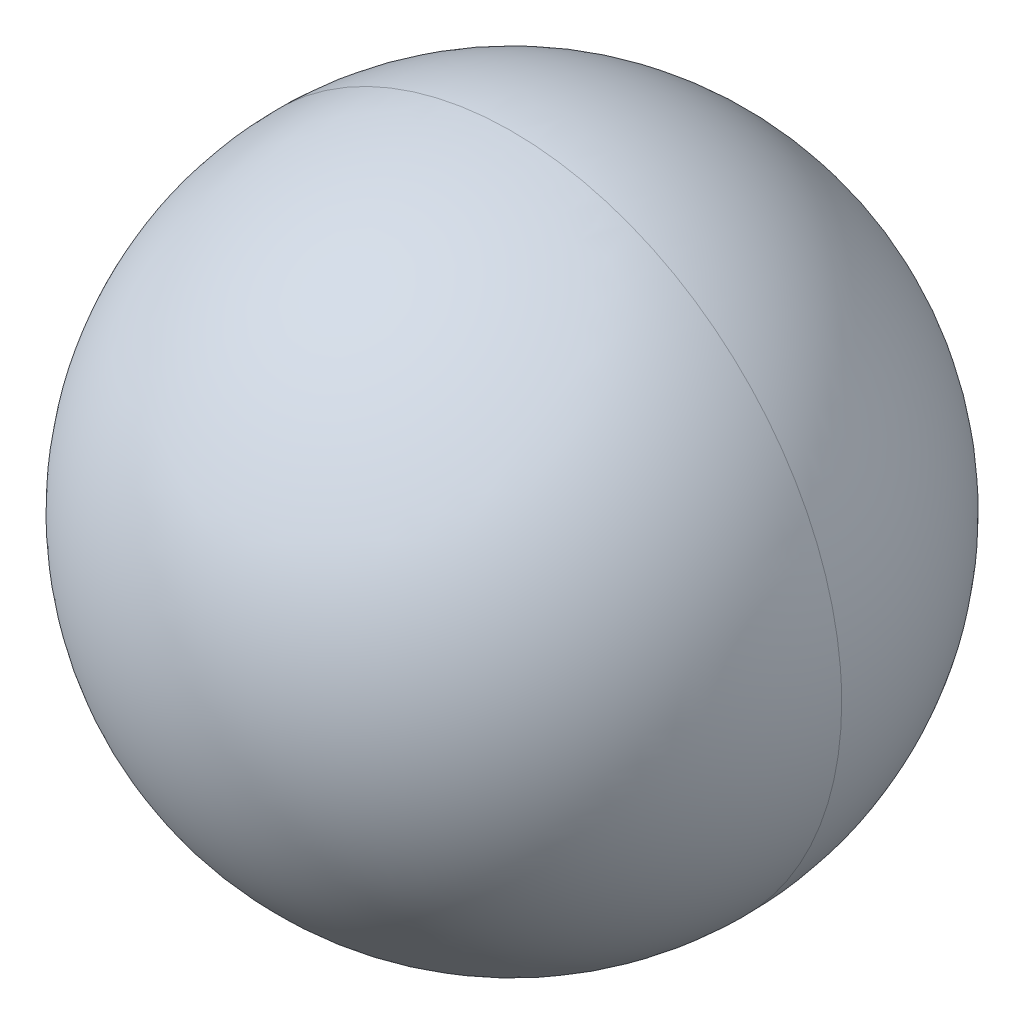
ISO-10303-21;
HEADER;
FILE_DESCRIPTION(('STEP AP214'),'2;1');
FILE_NAME('part.step','',(''),(''),'','','');
FILE_SCHEMA(('AUTOMOTIVE_DESIGN { 1 0 10303 214 1 1 1 1 }'));
ENDSEC;
DATA;
#1=APPLICATION_CONTEXT('core data for automotive mechanical design processes');
#2=APPLICATION_PROTOCOL_DEFINITION('international standard','automotive_design',2000,#1);
#3=PRODUCT_CONTEXT('',#1,'mechanical');
#4=PRODUCT('Part','Part','',(#3));
#5=PRODUCT_RELATED_PRODUCT_CATEGORY('part','',(#4));
#6=PRODUCT_DEFINITION_FORMATION('','',#4);
#7=PRODUCT_DEFINITION_CONTEXT('part definition',#1,'design');
#8=PRODUCT_DEFINITION('design','',#6,#7);
#9=PRODUCT_DEFINITION_SHAPE('','',#8);
#10=(LENGTH_UNIT() NAMED_UNIT(*) SI_UNIT(.MILLI.,.METRE.));
#11=(NAMED_UNIT(*) PLANE_ANGLE_UNIT() SI_UNIT($,.RADIAN.));
#12=(NAMED_UNIT(*) SI_UNIT($,.STERADIAN.) SOLID_ANGLE_UNIT());
#13=UNCERTAINTY_MEASURE_WITH_UNIT(LENGTH_MEASURE(1.E-05),#10,'distance_accuracy_value','');
#14=(GEOMETRIC_REPRESENTATION_CONTEXT(3) GLOBAL_UNCERTAINTY_ASSIGNED_CONTEXT((#13)) GLOBAL_UNIT_ASSIGNED_CONTEXT((#10,
#11,#12)) REPRESENTATION_CONTEXT('',''));
#15=CARTESIAN_POINT('',(0.,0.,0.));
#16=DIRECTION('',(0.,0.,1.));
#17=DIRECTION('',(1.,0.,0.));
#18=AXIS2_PLACEMENT_3D('',#15,#16,#17);
#19=CARTESIAN_POINT('',(0.,0.,0.));
#20=DIRECTION('',(1.,0.,0.));
#21=DIRECTION('',(0.,0.,1.));
#22=AXIS2_PLACEMENT_3D('',#19,#20,#21);
#23=SPHERICAL_SURFACE('',#22,0.75);
#24=CARTESIAN_POINT('',(0.,0.,0.));
#25=DIRECTION('',(0.,0.,1.));
#26=DIRECTION('',(0.,-1.,0.));
#27=AXIS2_PLACEMENT_3D('',#24,#25,#26);
#28=CIRCLE('',#27,0.75);
#29=CARTESIAN_POINT('',(-0.75,0.,0.));
#30=VERTEX_POINT('',#29);
#31=CARTESIAN_POINT('',(0.75,0.,0.));
#32=VERTEX_POINT('',#31);
#33=EDGE_CURVE('E11',#30,#32,#28,.T.);
#34=ORIENTED_EDGE('',*,*,#33,.F.);
#35=CARTESIAN_POINT('',(-0.75,0.,0.));
#36=CARTESIAN_POINT('',(-0.750000260316581,0.012271858695667,0.));
#37=CARTESIAN_POINT('',(-0.749698812843865,0.0245436952409446,0.));
#38=CARTESIAN_POINT('',(-0.748494371463894,0.0490578162501811,0.));
#39=CARTESIAN_POINT('',(-0.74759137755664,0.0613001007141399,0.));
#40=CARTESIAN_POINT('',(-0.745185712451655,0.0857256097801997,0.));
#41=CARTESIAN_POINT('',(-0.743683041253923,0.0979088343823006,0.));
#42=CARTESIAN_POINT('',(-0.740081723693248,0.122186877300741,0.));
#43=CARTESIAN_POINT('',(-0.737983077330304,0.13428169561708,0.));
#44=CARTESIAN_POINT('',(-0.733194843274542,0.158353787407111,0.));
#45=CARTESIAN_POINT('',(-0.730505255581723,0.170331060880804,0.));
#46=CARTESIAN_POINT('',(-0.724541624210094,0.194139208974091,0.));
#47=CARTESIAN_POINT('',(-0.721267580531284,0.205970083593686,0.));
#48=CARTESIAN_POINT('',(-0.71414292306703,0.229456932288006,0.));
#49=CARTESIAN_POINT('',(-0.710292309281587,0.24111290636273,0.));
#50=CARTESIAN_POINT('',(-0.702023788492945,0.264221873725599,0.));
#51=CARTESIAN_POINT('',(-0.697605881489746,0.275674867013743,0.));
#52=CARTESIAN_POINT('',(-0.688213417277185,0.29835028153389,0.));
#53=CARTESIAN_POINT('',(-0.683238860067823,0.309572702765892,0.));
#54=CARTESIAN_POINT('',(-0.672745079617343,0.33175993737953,0.));
#55=CARTESIAN_POINT('',(-0.667225856376225,0.342724750761165,0.));
#56=CARTESIAN_POINT('',(-0.655656040146309,0.36437035447783,0.));
#57=CARTESIAN_POINT('',(-0.649605447157512,0.375051144812859,0.));
#58=CARTESIAN_POINT('',(-0.636987467842898,0.396102971476973,0.));
#59=CARTESIAN_POINT('',(-0.630420081517081,0.406474007806058,0.));
#60=CARTESIAN_POINT('',(-0.616784336936738,0.426881341723344,0.));
#61=CARTESIAN_POINT('',(-0.609715978682212,0.436917639311545,0.));
#62=CARTESIAN_POINT('',(-0.595095318538757,0.456631317427104,0.));
#63=CARTESIAN_POINT('',(-0.587543016649828,0.466308697954462,0.));
#64=CARTESIAN_POINT('',(-0.571972663394279,0.485281228291005,0.));
#65=CARTESIAN_POINT('',(-0.563954612027659,0.49457637810019,0.));
#66=CARTESIAN_POINT('',(-0.547472076004781,0.512762054170337,0.));
#67=CARTESIAN_POINT('',(-0.539007591348522,0.521652580431299,0.));
#68=CARTESIAN_POINT('',(-0.521652580431301,0.539007591348521,0.));
#69=CARTESIAN_POINT('',(-0.512762054170338,0.54747207600478,0.));
#70=CARTESIAN_POINT('',(-0.494576378100191,0.563954612027657,0.));
#71=CARTESIAN_POINT('',(-0.485281228291006,0.571972663394275,0.));
#72=CARTESIAN_POINT('',(-0.466308697954464,0.587543016649829,0.));
#73=CARTESIAN_POINT('',(-0.456631317427106,0.595095318538765,0.));
#74=CARTESIAN_POINT('',(-0.436917639311546,0.609715978682201,0.));
#75=CARTESIAN_POINT('',(-0.426881341723344,0.616784336936701,0.));
#76=CARTESIAN_POINT('',(-0.406474007806061,0.630420081517115,0.));
#77=CARTESIAN_POINT('',(-0.396102971476981,0.63698746784303,0.));
#78=CARTESIAN_POINT('',(-0.375051144812854,0.649605447157377,0.));
#79=CARTESIAN_POINT('',(-0.364370354477807,0.655656040145811,0.));
#80=CARTESIAN_POINT('',(-0.342724750761192,0.66722585637672,0.));
#81=CARTESIAN_POINT('',(-0.331759937379623,0.672745079619195,0.));
#82=CARTESIAN_POINT('',(-0.309572702765803,0.683238860065969,0.));
#83=CARTESIAN_POINT('',(-0.298350281533552,0.688213417270267,0.));
#84=CARTESIAN_POINT('',(-0.275674867014085,0.697605881496662,0.));
#85=CARTESIAN_POINT('',(-0.264221873726869,0.702023788518759,0.));
#86=CARTESIAN_POINT('',(-0.241112906361464,0.710292309255771,0.));
#87=CARTESIAN_POINT('',(-0.229456932283275,0.714142922970687,0.));
#88=CARTESIAN_POINT('',(-0.205970083598421,0.721267580627625,0.));
#89=CARTESIAN_POINT('',(-0.194139208991757,0.724541624569647,0.));
#90=CARTESIAN_POINT('',(-0.170331060863142,0.730505255222168,0.));
#91=CARTESIAN_POINT('',(-0.158353787341191,0.733194841932667,0.));
#92=CARTESIAN_POINT('',(-0.134281695683004,0.737983078672178,0.));
#93=CARTESIAN_POINT('',(-0.122186877546767,0.740081728701189,0.));
#94=CARTESIAN_POINT('',(-0.0979088341362784,0.743683036245982,0.));
#95=CARTESIAN_POINT('',(-0.0857256088620265,0.745185693761765,0.));
#96=CARTESIAN_POINT('',(-0.0613001016323175,0.74759139624653,0.));
#97=CARTESIAN_POINT('',(-0.0490578196768606,0.748494441215512,0.));
#98=CARTESIAN_POINT('',(-0.0245436918142696,0.749698743092247,0.));
#99=CARTESIAN_POINT('',(-0.0122718459071356,0.75,0.));
#100=CARTESIAN_POINT('',(0.0122718459071324,0.75,0.));
#101=CARTESIAN_POINT('',(0.0245436918142664,0.749698743092247,0.));
#102=CARTESIAN_POINT('',(0.0490578196768574,0.748494441215512,0.));
#103=CARTESIAN_POINT('',(0.0613001016323144,0.74759139624653,0.));
#104=CARTESIAN_POINT('',(0.0857256088620234,0.745185693761765,0.));
#105=CARTESIAN_POINT('',(0.0979088341362753,0.743683036245983,0.));
#106=CARTESIAN_POINT('',(0.122186877546764,0.740081728701189,0.));
#107=CARTESIAN_POINT('',(0.134281695683001,0.737983078672178,0.));
#108=CARTESIAN_POINT('',(0.158353787341188,0.733194841932668,0.));
#109=CARTESIAN_POINT('',(0.170331060863139,0.730505255222169,0.));
#110=CARTESIAN_POINT('',(0.194139208991754,0.724541624569648,0.));
#111=CARTESIAN_POINT('',(0.205970083598418,0.721267580627626,0.));
#112=CARTESIAN_POINT('',(0.229456932283272,0.714142922970688,0.));
#113=CARTESIAN_POINT('',(0.241112906361461,0.710292309255772,0.));
#114=CARTESIAN_POINT('',(0.264221873726866,0.70202378851876,0.));
#115=CARTESIAN_POINT('',(0.275674867014082,0.697605881496663,0.));
#116=CARTESIAN_POINT('',(0.298350281533549,0.688213417270268,0.));
#117=CARTESIAN_POINT('',(0.3095727027658,0.68323886006597,0.));
#118=CARTESIAN_POINT('',(0.33175993737962,0.672745079619197,0.));
#119=CARTESIAN_POINT('',(0.342724750761189,0.667225856376722,0.));
#120=CARTESIAN_POINT('',(0.364370354477804,0.655656040145813,0.));
#121=CARTESIAN_POINT('',(0.375051144812851,0.649605447157379,0.));
#122=CARTESIAN_POINT('',(0.396102971476978,0.636987467843031,0.));
#123=CARTESIAN_POINT('',(0.406474007806059,0.630420081517117,0.));
#124=CARTESIAN_POINT('',(0.426881341723341,0.616784336936703,0.));
#125=CARTESIAN_POINT('',(0.436917639311544,0.609715978682203,0.));
#126=CARTESIAN_POINT('',(0.456631317427104,0.595095318538767,0.));
#127=CARTESIAN_POINT('',(0.466308697954461,0.587543016649831,0.));
#128=CARTESIAN_POINT('',(0.485281228291004,0.571972663394277,0.));
#129=CARTESIAN_POINT('',(0.494576378100189,0.563954612027659,0.));
#130=CARTESIAN_POINT('',(0.512762054170336,0.547472076004782,0.));
#131=CARTESIAN_POINT('',(0.521652580431299,0.539007591348523,0.));
#132=CARTESIAN_POINT('',(0.53900759134852,0.521652580431301,0.));
#133=CARTESIAN_POINT('',(0.547472076004779,0.512762054170339,0.));
#134=CARTESIAN_POINT('',(0.563954612027657,0.494576378100192,0.));
#135=CARTESIAN_POINT('',(0.571972663394277,0.485281228291007,0.));
#136=CARTESIAN_POINT('',(0.587543016649826,0.466308697954464,0.));
#137=CARTESIAN_POINT('',(0.595095318538755,0.456631317427106,0.));
#138=CARTESIAN_POINT('',(0.60971597868221,0.436917639311547,0.));
#139=CARTESIAN_POINT('',(0.616784336936737,0.426881341723346,0.));
#140=CARTESIAN_POINT('',(0.630420081517079,0.40647400780606,0.));
#141=CARTESIAN_POINT('',(0.636987467842896,0.396102971476975,0.));
#142=CARTESIAN_POINT('',(0.64960544715751,0.375051144812861,0.));
#143=CARTESIAN_POINT('',(0.655656040146307,0.364370354477832,0.));
#144=CARTESIAN_POINT('',(0.667225856376223,0.342724750761168,0.));
#145=CARTESIAN_POINT('',(0.672745079617341,0.331759937379532,0.));
#146=CARTESIAN_POINT('',(0.683238860067822,0.309572702765895,0.));
#147=CARTESIAN_POINT('',(0.688213417277184,0.298350281533893,0.));
#148=CARTESIAN_POINT('',(0.697605881489745,0.275674867013746,0.));
#149=CARTESIAN_POINT('',(0.702023788492944,0.264221873725601,0.));
#150=CARTESIAN_POINT('',(0.710292309281586,0.241112906362732,0.));
#151=CARTESIAN_POINT('',(0.714142923067029,0.229456932288008,0.));
#152=CARTESIAN_POINT('',(0.721267580531283,0.205970083593689,0.));
#153=CARTESIAN_POINT('',(0.724541624210093,0.194139208974094,0.));
#154=CARTESIAN_POINT('',(0.730505255581722,0.170331060880806,0.));
#155=CARTESIAN_POINT('',(0.733194843274541,0.158353787407114,0.));
#156=CARTESIAN_POINT('',(0.737983077330304,0.134281695617083,0.));
#157=CARTESIAN_POINT('',(0.740081723693248,0.122186877300744,0.));
#158=CARTESIAN_POINT('',(0.743683041253923,0.0979088343823036,0.));
#159=CARTESIAN_POINT('',(0.745185712451655,0.0857256097802029,0.));
#160=CARTESIAN_POINT('',(0.74759137755664,0.0613001007141432,0.));
#161=CARTESIAN_POINT('',(0.748494371463894,0.0490578162501844,0.));
#162=CARTESIAN_POINT('',(0.749698812843865,0.0245436952409478,0.));
#163=CARTESIAN_POINT('',(0.750000260316581,0.0122718586956701,0.));
#164=CARTESIAN_POINT('',(0.75,0.,0.));
#165=B_SPLINE_CURVE_WITH_KNOTS('',3,(#35,#36,#37,#38,#39,#40,#41,#42,#43,#44,#45,#46,#47,#48,
#49,#50,#51,#52,#53,#54,#55,#56,#57,#58,#59,#60,#61,#62,#63,#64,#65,#66,#67,#68,#69,#70,#71,#72,
#73,#74,#75,#76,#77,#78,#79,#80,#81,#82,#83,#84,#85,#86,#87,#88,#89,#90,#91,#92,#93,#94,#95,#96,
#97,#98,#99,#100,#101,#102,#103,#104,#105,#106,#107,#108,#109,#110,#111,#112,#113,#114,#115,
#116,#117,#118,#119,#120,#121,#122,#123,#124,#125,#126,#127,#128,#129,#130,#131,#132,#133,#134,
#135,#136,#137,#138,#139,#140,#141,#142,#143,#144,#145,#146,#147,#148,#149,#150,#151,#152,#153,
#154,#155,#156,#157,#158,#159,#160,#161,#162,#163,#164),.UNSPECIFIED.,.F.,.F.,(4,2,2,2,2,2,2,2,
2,2,2,2,2,2,2,2,2,2,2,2,2,2,2,2,2,2,2,2,2,2,2,2,2,2,2,2,2,2,2,2,2,2,2,2,2,2,2,2,2,2,2,2,2,2,2,2,
2,2,2,2,2,2,2,2,4),(0.,0.0368118427843683,0.0736236855687368,0.110435528353105,
0.147247371137474,0.184059213921842,0.220871056706211,0.257682899490579,0.294494742274947,
0.331306585059316,0.368118427843684,0.404930270628053,0.441742113412421,0.478553956196789,
0.515365798981158,0.552177641765526,0.588989484549895,0.625801327334263,0.662613170118631,
0.699425012903,0.736236855687368,0.773048698471736,0.809860541256105,0.846672384040473,
0.883484226824842,0.92029606960921,0.957107912393579,0.993919755177947,1.03073159796232,
1.06754344074668,1.10435528353105,1.14116712631542,1.17797896909979,1.21479081188416,
1.25160265466853,1.28841449745289,1.32522634023726,1.36203818302163,1.398850025806,
1.43566186859037,1.47247371137474,1.5092855541591,1.54609739694347,1.58290923972784,
1.61972108251221,1.65653292529658,1.69334476808095,1.73015661086532,1.76696845364968,
1.80378029643405,1.84059213921842,1.87740398200279,1.91421582478716,1.95102766757153,
1.98783951035589,2.02465135314026,2.06146319592463,2.098275038709,2.13508688149337,
2.17189872427774,2.20871056706211,2.24552240984647,2.28233425263084,2.31914609541521,
2.35595793819958),.UNSPECIFIED.);
#166=EDGE_CURVE('E26',#30,#32,#165,.T.);
#167=ORIENTED_EDGE('',*,*,#166,.T.);
#168=EDGE_LOOP('',(#34,#167));
#169=FACE_BOUND('',#168,.T.);
#170=ADVANCED_FACE('F17',(#169),#23,.T.);
#171=CARTESIAN_POINT('',(0.,0.,0.));
#172=DIRECTION('',(1.,0.,0.));
#173=DIRECTION('',(0.,0.,-1.));
#174=AXIS2_PLACEMENT_3D('',#171,#172,#173);
#175=SPHERICAL_SURFACE('',#174,0.75);
#176=ORIENTED_EDGE('',*,*,#33,.T.);
#177=ORIENTED_EDGE('',*,*,#166,.F.);
#178=EDGE_LOOP('',(#176,#177));
#179=FACE_BOUND('',#178,.T.);
#180=ADVANCED_FACE('F36',(#179),#175,.T.);
#181=CLOSED_SHELL('',(#170,#180));
#182=MANIFOLD_SOLID_BREP('B1',#181);
#183=ADVANCED_BREP_SHAPE_REPRESENTATION('',(#18,#182),#14);
#184=SHAPE_DEFINITION_REPRESENTATION(#9,#183);
ENDSEC;
END-ISO-10303-21;
